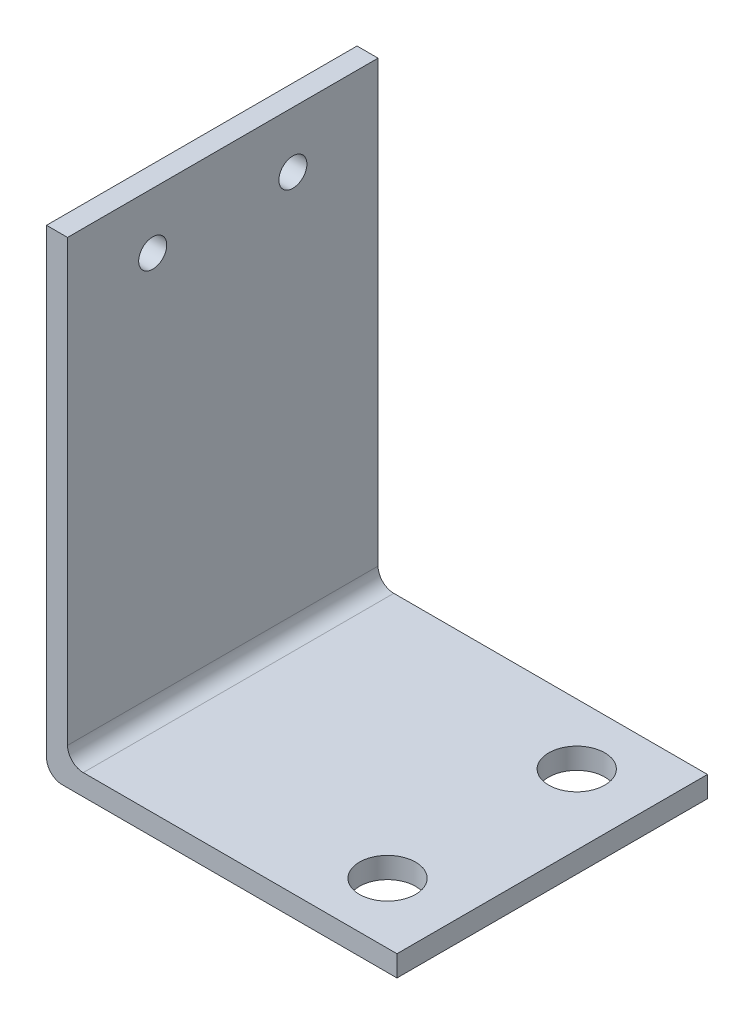
ISO-10303-21;
HEADER;
FILE_DESCRIPTION(('STEP AP214'),'2;1');
FILE_NAME('part.step','',(''),(''),'','','');
FILE_SCHEMA(('AUTOMOTIVE_DESIGN { 1 0 10303 214 1 1 1 1 }'));
ENDSEC;
DATA;
#1=APPLICATION_CONTEXT('core data for automotive mechanical design processes');
#2=APPLICATION_PROTOCOL_DEFINITION('international standard','automotive_design',2000,#1);
#3=PRODUCT_CONTEXT('',#1,'mechanical');
#4=PRODUCT('Part','Part','',(#3));
#5=PRODUCT_RELATED_PRODUCT_CATEGORY('part','',(#4));
#6=PRODUCT_DEFINITION_FORMATION('','',#4);
#7=PRODUCT_DEFINITION_CONTEXT('part definition',#1,'design');
#8=PRODUCT_DEFINITION('design','',#6,#7);
#9=PRODUCT_DEFINITION_SHAPE('','',#8);
#10=(LENGTH_UNIT() NAMED_UNIT(*) SI_UNIT(.MILLI.,.METRE.));
#11=(NAMED_UNIT(*) PLANE_ANGLE_UNIT() SI_UNIT($,.RADIAN.));
#12=(NAMED_UNIT(*) SI_UNIT($,.STERADIAN.) SOLID_ANGLE_UNIT());
#13=UNCERTAINTY_MEASURE_WITH_UNIT(LENGTH_MEASURE(1.E-05),#10,'distance_accuracy_value','');
#14=(GEOMETRIC_REPRESENTATION_CONTEXT(3) GLOBAL_UNCERTAINTY_ASSIGNED_CONTEXT((#13)) GLOBAL_UNIT_ASSIGNED_CONTEXT((#10,
#11,#12)) REPRESENTATION_CONTEXT('',''));
#15=CARTESIAN_POINT('',(0.,0.,0.));
#16=DIRECTION('',(0.,0.,1.));
#17=DIRECTION('',(1.,0.,0.));
#18=AXIS2_PLACEMENT_3D('',#15,#16,#17);
#19=CARTESIAN_POINT('',(0.,34.,22.15));
#20=DIRECTION('',(0.,-1.,0.));
#21=DIRECTION('',(0.,0.,-1.));
#22=AXIS2_PLACEMENT_3D('',#19,#20,#21);
#23=PLANE('',#22);
#24=DIRECTION('',(-1.,0.,0.));
#25=VECTOR('',#24,1.);
#26=CARTESIAN_POINT('',(0.,34.,0.));
#27=LINE('',#26,#25);
#28=CARTESIAN_POINT('',(1.5,34.,0.));
#29=VERTEX_POINT('',#28);
#30=CARTESIAN_POINT('',(0.,34.,0.));
#31=VERTEX_POINT('',#30);
#32=EDGE_CURVE('E129',#29,#31,#27,.T.);
#33=ORIENTED_EDGE('',*,*,#32,.T.);
#34=DIRECTION('',(0.,0.,-1.));
#35=VECTOR('',#34,1.);
#36=CARTESIAN_POINT('',(0.,34.,22.15));
#37=LINE('',#36,#35);
#38=CARTESIAN_POINT('',(0.,34.,22.15));
#39=VERTEX_POINT('',#38);
#40=EDGE_CURVE('E11',#39,#31,#37,.T.);
#41=ORIENTED_EDGE('',*,*,#40,.F.);
#42=DIRECTION('',(-1.,0.,0.));
#43=VECTOR('',#42,1.);
#44=CARTESIAN_POINT('',(0.,34.,22.15));
#45=LINE('',#44,#43);
#46=CARTESIAN_POINT('',(1.5,34.,22.15));
#47=VERTEX_POINT('',#46);
#48=EDGE_CURVE('E144',#47,#39,#45,.T.);
#49=ORIENTED_EDGE('',*,*,#48,.F.);
#50=DIRECTION('',(0.,0.,-1.));
#51=VECTOR('',#50,1.);
#52=CARTESIAN_POINT('',(1.5,34.,22.15));
#53=LINE('',#52,#51);
#54=EDGE_CURVE('E125',#47,#29,#53,.T.);
#55=ORIENTED_EDGE('',*,*,#54,.T.);
#56=EDGE_LOOP('',(#33,#41,#49,#55));
#57=FACE_BOUND('',#56,.T.);
#58=ADVANCED_FACE('F33',(#57),#23,.F.);
#59=CARTESIAN_POINT('',(0.,1.12229101930364,22.15));
#60=DIRECTION('',(1.,0.,0.));
#61=DIRECTION('',(0.,0.,-1.));
#62=AXIS2_PLACEMENT_3D('',#59,#60,#61);
#63=PLANE('',#62);
#64=CARTESIAN_POINT('',(0.,30.,6.075));
#65=DIRECTION('',(1.,0.,0.));
#66=DIRECTION('',(0.,0.,-1.));
#67=AXIS2_PLACEMENT_3D('',#64,#65,#66);
#68=CIRCLE('',#67,1.);
#69=CARTESIAN_POINT('',(0.,30.,5.075));
#70=VERTEX_POINT('',#69);
#71=EDGE_CURVE('E192',#70,#70,#68,.T.);
#72=ORIENTED_EDGE('',*,*,#71,.T.);
#73=EDGE_LOOP('',(#72));
#74=FACE_BOUND('',#73,.T.);
#75=CARTESIAN_POINT('',(0.,30.,16.075));
#76=DIRECTION('',(1.,0.,0.));
#77=DIRECTION('',(0.,0.,-1.));
#78=AXIS2_PLACEMENT_3D('',#75,#76,#77);
#79=CIRCLE('',#78,1.);
#80=CARTESIAN_POINT('',(0.,30.,15.075));
#81=VERTEX_POINT('',#80);
#82=EDGE_CURVE('E186',#81,#81,#79,.T.);
#83=ORIENTED_EDGE('',*,*,#82,.T.);
#84=EDGE_LOOP('',(#83));
#85=FACE_BOUND('',#84,.T.);
#86=DIRECTION('',(0.,-1.,0.));
#87=VECTOR('',#86,1.);
#88=CARTESIAN_POINT('',(0.,1.12229101930364,0.));
#89=LINE('',#88,#87);
#90=CARTESIAN_POINT('',(0.,1.12229101930364,0.));
#91=VERTEX_POINT('',#90);
#92=EDGE_CURVE('E132',#31,#91,#89,.T.);
#93=ORIENTED_EDGE('',*,*,#92,.T.);
#94=DIRECTION('',(0.,0.,-1.));
#95=VECTOR('',#94,1.);
#96=CARTESIAN_POINT('',(0.,1.12229101930364,22.15));
#97=LINE('',#96,#95);
#98=CARTESIAN_POINT('',(0.,1.12229101930364,22.15));
#99=VERTEX_POINT('',#98);
#100=EDGE_CURVE('E41',#99,#91,#97,.T.);
#101=ORIENTED_EDGE('',*,*,#100,.F.);
#102=DIRECTION('',(0.,-1.,0.));
#103=VECTOR('',#102,1.);
#104=CARTESIAN_POINT('',(0.,1.12229101930364,22.15));
#105=LINE('',#104,#103);
#106=EDGE_CURVE('E92',#39,#99,#105,.T.);
#107=ORIENTED_EDGE('',*,*,#106,.F.);
#108=ORIENTED_EDGE('',*,*,#40,.T.);
#109=EDGE_LOOP('',(#93,#101,#107,#108));
#110=FACE_BOUND('',#109,.T.);
#111=ADVANCED_FACE('F201',(#74,#85,#110),#63,.F.);
#112=CARTESIAN_POINT('',(1.12229101930363,1.12229101930363,22.15));
#113=DIRECTION('',(0.,0.,-1.));
#114=DIRECTION('',(-1.,0.,0.));
#115=AXIS2_PLACEMENT_3D('',#112,#113,#114);
#116=CYLINDRICAL_SURFACE('',#115,1.12229101930363);
#117=CARTESIAN_POINT('',(1.12229101930363,1.12229101930363,0.));
#118=DIRECTION('',(0.,0.,1.));
#119=DIRECTION('',(1.,0.,0.));
#120=AXIS2_PLACEMENT_3D('',#117,#118,#119);
#121=CIRCLE('',#120,1.12229101930363);
#122=CARTESIAN_POINT('',(1.12229101930364,0.,0.));
#123=VERTEX_POINT('',#122);
#124=EDGE_CURVE('E135',#91,#123,#121,.T.);
#125=ORIENTED_EDGE('',*,*,#124,.T.);
#126=DIRECTION('',(0.,0.,-1.));
#127=VECTOR('',#126,1.);
#128=CARTESIAN_POINT('',(1.12229101930364,0.,22.15));
#129=LINE('',#128,#127);
#130=CARTESIAN_POINT('',(1.12229101930364,0.,22.15));
#131=VERTEX_POINT('',#130);
#132=EDGE_CURVE('E151',#131,#123,#129,.T.);
#133=ORIENTED_EDGE('',*,*,#132,.F.);
#134=CARTESIAN_POINT('',(1.12229101930363,1.12229101930363,22.15));
#135=DIRECTION('',(0.,0.,1.));
#136=DIRECTION('',(1.,0.,0.));
#137=AXIS2_PLACEMENT_3D('',#134,#135,#136);
#138=CIRCLE('',#137,1.12229101930363);
#139=EDGE_CURVE('E159',#99,#131,#138,.T.);
#140=ORIENTED_EDGE('',*,*,#139,.F.);
#141=ORIENTED_EDGE('',*,*,#100,.T.);
#142=EDGE_LOOP('',(#125,#133,#140,#141));
#143=FACE_BOUND('',#142,.T.);
#144=ADVANCED_FACE('F157',(#143),#116,.T.);
#145=CARTESIAN_POINT('',(1.12229101930364,0.,22.15));
#146=DIRECTION('',(0.,1.,0.));
#147=DIRECTION('',(0.,0.,1.));
#148=AXIS2_PLACEMENT_3D('',#145,#146,#147);
#149=PLANE('',#148);
#150=CARTESIAN_POINT('',(20.,0.,17.825));
#151=DIRECTION('',(0.,1.,0.));
#152=DIRECTION('',(0.,0.,1.));
#153=AXIS2_PLACEMENT_3D('',#150,#151,#152);
#154=CIRCLE('',#153,2.00000000000001);
#155=CARTESIAN_POINT('',(20.,0.,19.825));
#156=VERTEX_POINT('',#155);
#157=EDGE_CURVE('E180',#156,#156,#154,.T.);
#158=ORIENTED_EDGE('',*,*,#157,.T.);
#159=EDGE_LOOP('',(#158));
#160=FACE_BOUND('',#159,.T.);
#161=CARTESIAN_POINT('',(20.,0.,4.325));
#162=DIRECTION('',(0.,1.,0.));
#163=DIRECTION('',(0.,0.,1.));
#164=AXIS2_PLACEMENT_3D('',#161,#162,#163);
#165=CIRCLE('',#164,2.);
#166=CARTESIAN_POINT('',(20.,0.,6.325));
#167=VERTEX_POINT('',#166);
#168=EDGE_CURVE('E133',#167,#167,#165,.T.);
#169=ORIENTED_EDGE('',*,*,#168,.T.);
#170=EDGE_LOOP('',(#169));
#171=FACE_BOUND('',#170,.T.);
#172=DIRECTION('',(1.,0.,0.));
#173=VECTOR('',#172,1.);
#174=CARTESIAN_POINT('',(1.12229101930364,0.,0.));
#175=LINE('',#174,#173);
#176=CARTESIAN_POINT('',(25.,0.,0.));
#177=VERTEX_POINT('',#176);
#178=EDGE_CURVE('E137',#123,#177,#175,.T.);
#179=ORIENTED_EDGE('',*,*,#178,.T.);
#180=DIRECTION('',(0.,0.,-1.));
#181=VECTOR('',#180,1.);
#182=CARTESIAN_POINT('',(25.,0.,22.15));
#183=LINE('',#182,#181);
#184=CARTESIAN_POINT('',(25.,0.,22.15));
#185=VERTEX_POINT('',#184);
#186=EDGE_CURVE('E148',#185,#177,#183,.T.);
#187=ORIENTED_EDGE('',*,*,#186,.F.);
#188=DIRECTION('',(1.,0.,0.));
#189=VECTOR('',#188,1.);
#190=CARTESIAN_POINT('',(1.12229101930364,0.,22.15));
#191=LINE('',#190,#189);
#192=EDGE_CURVE('E171',#131,#185,#191,.T.);
#193=ORIENTED_EDGE('',*,*,#192,.F.);
#194=ORIENTED_EDGE('',*,*,#132,.T.);
#195=EDGE_LOOP('',(#179,#187,#193,#194));
#196=FACE_BOUND('',#195,.T.);
#197=ADVANCED_FACE('F167',(#160,#171,#196),#149,.F.);
#198=CARTESIAN_POINT('',(25.,0.,22.15));
#199=DIRECTION('',(-1.,0.,0.));
#200=DIRECTION('',(0.,0.,1.));
#201=AXIS2_PLACEMENT_3D('',#198,#199,#200);
#202=PLANE('',#201);
#203=DIRECTION('',(0.,1.,0.));
#204=VECTOR('',#203,1.);
#205=CARTESIAN_POINT('',(25.,0.,0.));
#206=LINE('',#205,#204);
#207=CARTESIAN_POINT('',(25.,1.5,0.));
#208=VERTEX_POINT('',#207);
#209=EDGE_CURVE('E139',#177,#208,#206,.T.);
#210=ORIENTED_EDGE('',*,*,#209,.T.);
#211=DIRECTION('',(0.,0.,-1.));
#212=VECTOR('',#211,1.);
#213=CARTESIAN_POINT('',(25.,1.5,22.15));
#214=LINE('',#213,#212);
#215=CARTESIAN_POINT('',(25.,1.5,22.15));
#216=VERTEX_POINT('',#215);
#217=EDGE_CURVE('E120',#216,#208,#214,.T.);
#218=ORIENTED_EDGE('',*,*,#217,.F.);
#219=DIRECTION('',(0.,1.,0.));
#220=VECTOR('',#219,1.);
#221=CARTESIAN_POINT('',(25.,0.,22.15));
#222=LINE('',#221,#220);
#223=EDGE_CURVE('E111',#185,#216,#222,.T.);
#224=ORIENTED_EDGE('',*,*,#223,.F.);
#225=ORIENTED_EDGE('',*,*,#186,.T.);
#226=EDGE_LOOP('',(#210,#218,#224,#225));
#227=FACE_BOUND('',#226,.T.);
#228=ADVANCED_FACE('F170',(#227),#202,.F.);
#229=CARTESIAN_POINT('',(2.62229101930364,1.5,22.15));
#230=DIRECTION('',(0.,-1.,0.));
#231=DIRECTION('',(0.,0.,-1.));
#232=AXIS2_PLACEMENT_3D('',#229,#230,#231);
#233=PLANE('',#232);
#234=CARTESIAN_POINT('',(20.,1.5,17.825));
#235=DIRECTION('',(0.,1.,0.));
#236=DIRECTION('',(0.,0.,1.));
#237=AXIS2_PLACEMENT_3D('',#234,#235,#236);
#238=CIRCLE('',#237,2.00000000000001);
#239=CARTESIAN_POINT('',(20.,1.5,19.825));
#240=VERTEX_POINT('',#239);
#241=EDGE_CURVE('E183',#240,#240,#238,.T.);
#242=ORIENTED_EDGE('',*,*,#241,.F.);
#243=EDGE_LOOP('',(#242));
#244=FACE_BOUND('',#243,.T.);
#245=CARTESIAN_POINT('',(20.,1.5,4.325));
#246=DIRECTION('',(0.,1.,0.));
#247=DIRECTION('',(0.,0.,1.));
#248=AXIS2_PLACEMENT_3D('',#245,#246,#247);
#249=CIRCLE('',#248,2.);
#250=CARTESIAN_POINT('',(20.,1.5,6.325));
#251=VERTEX_POINT('',#250);
#252=EDGE_CURVE('E177',#251,#251,#249,.T.);
#253=ORIENTED_EDGE('',*,*,#252,.F.);
#254=EDGE_LOOP('',(#253));
#255=FACE_BOUND('',#254,.T.);
#256=DIRECTION('',(-1.,0.,0.));
#257=VECTOR('',#256,1.);
#258=CARTESIAN_POINT('',(2.62229101930364,1.5,0.));
#259=LINE('',#258,#257);
#260=CARTESIAN_POINT('',(2.62229101930364,1.5,0.));
#261=VERTEX_POINT('',#260);
#262=EDGE_CURVE('E119',#208,#261,#259,.T.);
#263=ORIENTED_EDGE('',*,*,#262,.T.);
#264=DIRECTION('',(0.,0.,-1.));
#265=VECTOR('',#264,1.);
#266=CARTESIAN_POINT('',(2.62229101930364,1.5,22.15));
#267=LINE('',#266,#265);
#268=CARTESIAN_POINT('',(2.62229101930364,1.5,22.15));
#269=VERTEX_POINT('',#268);
#270=EDGE_CURVE('E116',#269,#261,#267,.T.);
#271=ORIENTED_EDGE('',*,*,#270,.F.);
#272=DIRECTION('',(-1.,0.,0.));
#273=VECTOR('',#272,1.);
#274=CARTESIAN_POINT('',(2.62229101930364,1.5,22.15));
#275=LINE('',#274,#273);
#276=EDGE_CURVE('E105',#216,#269,#275,.T.);
#277=ORIENTED_EDGE('',*,*,#276,.F.);
#278=ORIENTED_EDGE('',*,*,#217,.T.);
#279=EDGE_LOOP('',(#263,#271,#277,#278));
#280=FACE_BOUND('',#279,.T.);
#281=ADVANCED_FACE('F117',(#244,#255,#280),#233,.F.);
#282=CARTESIAN_POINT('',(2.62229101930363,2.62229101930363,22.15));
#283=DIRECTION('',(0.,0.,-1.));
#284=DIRECTION('',(-1.,0.,0.));
#285=AXIS2_PLACEMENT_3D('',#282,#283,#284);
#286=CYLINDRICAL_SURFACE('',#285,1.12229101930363);
#287=CARTESIAN_POINT('',(2.62229101930363,2.62229101930363,0.));
#288=DIRECTION('',(0.,0.,-1.));
#289=DIRECTION('',(-1.,0.,0.));
#290=AXIS2_PLACEMENT_3D('',#287,#288,#289);
#291=CIRCLE('',#290,1.12229101930363);
#292=CARTESIAN_POINT('',(1.5,2.62229101930364,0.));
#293=VERTEX_POINT('',#292);
#294=EDGE_CURVE('E78',#261,#293,#291,.T.);
#295=ORIENTED_EDGE('',*,*,#294,.T.);
#296=DIRECTION('',(0.,0.,-1.));
#297=VECTOR('',#296,1.);
#298=CARTESIAN_POINT('',(1.5,2.62229101930364,22.15));
#299=LINE('',#298,#297);
#300=CARTESIAN_POINT('',(1.5,2.62229101930364,22.15));
#301=VERTEX_POINT('',#300);
#302=EDGE_CURVE('E121',#301,#293,#299,.T.);
#303=ORIENTED_EDGE('',*,*,#302,.F.);
#304=CARTESIAN_POINT('',(2.62229101930363,2.62229101930363,22.15));
#305=DIRECTION('',(0.,0.,-1.));
#306=DIRECTION('',(-1.,0.,0.));
#307=AXIS2_PLACEMENT_3D('',#304,#305,#306);
#308=CIRCLE('',#307,1.12229101930363);
#309=EDGE_CURVE('E109',#269,#301,#308,.T.);
#310=ORIENTED_EDGE('',*,*,#309,.F.);
#311=ORIENTED_EDGE('',*,*,#270,.T.);
#312=EDGE_LOOP('',(#295,#303,#310,#311));
#313=FACE_BOUND('',#312,.T.);
#314=ADVANCED_FACE('F123',(#313),#286,.F.);
#315=CARTESIAN_POINT('',(1.5,2.62229101930364,22.15));
#316=DIRECTION('',(-1.,0.,0.));
#317=DIRECTION('',(0.,0.,1.));
#318=AXIS2_PLACEMENT_3D('',#315,#316,#317);
#319=PLANE('',#318);
#320=CARTESIAN_POINT('',(1.5,30.,6.075));
#321=DIRECTION('',(1.,0.,0.));
#322=DIRECTION('',(0.,0.,-1.));
#323=AXIS2_PLACEMENT_3D('',#320,#321,#322);
#324=CIRCLE('',#323,1.);
#325=CARTESIAN_POINT('',(1.5,30.,5.075));
#326=VERTEX_POINT('',#325);
#327=EDGE_CURVE('E195',#326,#326,#324,.T.);
#328=ORIENTED_EDGE('',*,*,#327,.F.);
#329=EDGE_LOOP('',(#328));
#330=FACE_BOUND('',#329,.T.);
#331=CARTESIAN_POINT('',(1.5,30.,16.075));
#332=DIRECTION('',(1.,0.,0.));
#333=DIRECTION('',(0.,0.,-1.));
#334=AXIS2_PLACEMENT_3D('',#331,#332,#333);
#335=CIRCLE('',#334,1.);
#336=CARTESIAN_POINT('',(1.5,30.,15.075));
#337=VERTEX_POINT('',#336);
#338=EDGE_CURVE('E189',#337,#337,#335,.T.);
#339=ORIENTED_EDGE('',*,*,#338,.F.);
#340=EDGE_LOOP('',(#339));
#341=FACE_BOUND('',#340,.T.);
#342=DIRECTION('',(0.,1.,0.));
#343=VECTOR('',#342,1.);
#344=CARTESIAN_POINT('',(1.5,2.62229101930364,0.));
#345=LINE('',#344,#343);
#346=EDGE_CURVE('E84',#293,#29,#345,.T.);
#347=ORIENTED_EDGE('',*,*,#346,.T.);
#348=ORIENTED_EDGE('',*,*,#54,.F.);
#349=DIRECTION('',(0.,1.,0.));
#350=VECTOR('',#349,1.);
#351=CARTESIAN_POINT('',(1.5,2.62229101930364,22.15));
#352=LINE('',#351,#350);
#353=EDGE_CURVE('E49',#301,#47,#352,.T.);
#354=ORIENTED_EDGE('',*,*,#353,.F.);
#355=ORIENTED_EDGE('',*,*,#302,.T.);
#356=EDGE_LOOP('',(#347,#348,#354,#355));
#357=FACE_BOUND('',#356,.T.);
#358=ADVANCED_FACE('F211',(#330,#341,#357),#319,.F.);
#359=CARTESIAN_POINT('',(2.62229101930363,2.62229101930363,22.15));
#360=DIRECTION('',(0.,0.,-1.));
#361=DIRECTION('',(-1.,0.,0.));
#362=AXIS2_PLACEMENT_3D('',#359,#360,#361);
#363=PLANE('',#362);
#364=ORIENTED_EDGE('',*,*,#48,.T.);
#365=ORIENTED_EDGE('',*,*,#106,.T.);
#366=ORIENTED_EDGE('',*,*,#139,.T.);
#367=ORIENTED_EDGE('',*,*,#192,.T.);
#368=ORIENTED_EDGE('',*,*,#223,.T.);
#369=ORIENTED_EDGE('',*,*,#276,.T.);
#370=ORIENTED_EDGE('',*,*,#309,.T.);
#371=ORIENTED_EDGE('',*,*,#353,.T.);
#372=EDGE_LOOP('',(#364,#365,#366,#367,#368,#369,#370,#371));
#373=FACE_BOUND('',#372,.T.);
#374=ADVANCED_FACE('F107',(#373),#363,.F.);
#375=CARTESIAN_POINT('',(2.62229101930363,2.62229101930363,0.));
#376=DIRECTION('',(0.,0.,-1.));
#377=DIRECTION('',(-1.,0.,0.));
#378=AXIS2_PLACEMENT_3D('',#375,#376,#377);
#379=PLANE('',#378);
#380=ORIENTED_EDGE('',*,*,#32,.F.);
#381=ORIENTED_EDGE('',*,*,#346,.F.);
#382=ORIENTED_EDGE('',*,*,#294,.F.);
#383=ORIENTED_EDGE('',*,*,#262,.F.);
#384=ORIENTED_EDGE('',*,*,#209,.F.);
#385=ORIENTED_EDGE('',*,*,#178,.F.);
#386=ORIENTED_EDGE('',*,*,#124,.F.);
#387=ORIENTED_EDGE('',*,*,#92,.F.);
#388=EDGE_LOOP('',(#380,#381,#382,#383,#384,#385,#386,#387));
#389=FACE_BOUND('',#388,.T.);
#390=ADVANCED_FACE('F163',(#389),#379,.T.);
#391=CARTESIAN_POINT('',(20.,0.,4.325));
#392=DIRECTION('',(0.,1.,0.));
#393=DIRECTION('',(0.,0.,1.));
#394=AXIS2_PLACEMENT_3D('',#391,#392,#393);
#395=CYLINDRICAL_SURFACE('',#394,2.);
#396=ORIENTED_EDGE('',*,*,#168,.F.);
#397=EDGE_LOOP('',(#396));
#398=FACE_BOUND('',#397,.T.);
#399=ORIENTED_EDGE('',*,*,#252,.T.);
#400=EDGE_LOOP('',(#399));
#401=FACE_BOUND('',#400,.T.);
#402=ADVANCED_FACE('F224',(#398,#401),#395,.F.);
#403=CARTESIAN_POINT('',(20.,0.,17.825));
#404=DIRECTION('',(0.,1.,0.));
#405=DIRECTION('',(0.,0.,1.));
#406=AXIS2_PLACEMENT_3D('',#403,#404,#405);
#407=CYLINDRICAL_SURFACE('',#406,2.00000000000001);
#408=ORIENTED_EDGE('',*,*,#157,.F.);
#409=EDGE_LOOP('',(#408));
#410=FACE_BOUND('',#409,.T.);
#411=ORIENTED_EDGE('',*,*,#241,.T.);
#412=EDGE_LOOP('',(#411));
#413=FACE_BOUND('',#412,.T.);
#414=ADVANCED_FACE('F218',(#410,#413),#407,.F.);
#415=CARTESIAN_POINT('',(0.,30.,16.075));
#416=DIRECTION('',(1.,0.,0.));
#417=DIRECTION('',(0.,0.,-1.));
#418=AXIS2_PLACEMENT_3D('',#415,#416,#417);
#419=CYLINDRICAL_SURFACE('',#418,1.);
#420=ORIENTED_EDGE('',*,*,#82,.F.);
#421=EDGE_LOOP('',(#420));
#422=FACE_BOUND('',#421,.T.);
#423=ORIENTED_EDGE('',*,*,#338,.T.);
#424=EDGE_LOOP('',(#423));
#425=FACE_BOUND('',#424,.T.);
#426=ADVANCED_FACE('F207',(#422,#425),#419,.F.);
#427=CARTESIAN_POINT('',(0.,30.,6.075));
#428=DIRECTION('',(1.,0.,0.));
#429=DIRECTION('',(0.,0.,-1.));
#430=AXIS2_PLACEMENT_3D('',#427,#428,#429);
#431=CYLINDRICAL_SURFACE('',#430,1.);
#432=ORIENTED_EDGE('',*,*,#71,.F.);
#433=EDGE_LOOP('',(#432));
#434=FACE_BOUND('',#433,.T.);
#435=ORIENTED_EDGE('',*,*,#327,.T.);
#436=EDGE_LOOP('',(#435));
#437=FACE_BOUND('',#436,.T.);
#438=ADVANCED_FACE('F204',(#434,#437),#431,.F.);
#439=CLOSED_SHELL('',(#58,#111,#144,#197,#228,#281,#314,#358,#374,#390,#402,#414,#426,#438));
#440=MANIFOLD_SOLID_BREP('B2',#439);
#441=ADVANCED_BREP_SHAPE_REPRESENTATION('',(#18,#440),#14);
#442=SHAPE_DEFINITION_REPRESENTATION(#9,#441);
ENDSEC;
END-ISO-10303-21;
